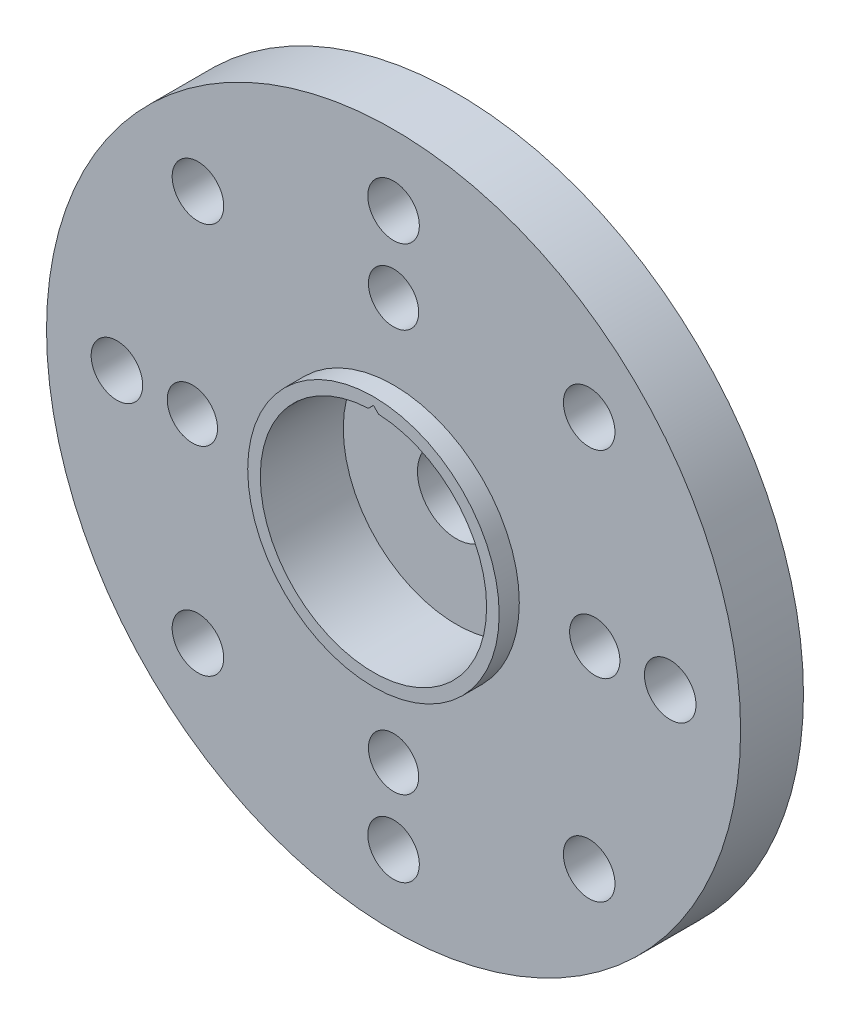
ISO-10303-21;
HEADER;
FILE_DESCRIPTION(('STEP AP214'),'2;1');
FILE_NAME('part.step','',(''),(''),'','','');
FILE_SCHEMA(('AUTOMOTIVE_DESIGN { 1 0 10303 214 1 1 1 1 }'));
ENDSEC;
DATA;
#1=APPLICATION_CONTEXT('core data for automotive mechanical design processes');
#2=APPLICATION_PROTOCOL_DEFINITION('international standard','automotive_design',2000,#1);
#3=PRODUCT_CONTEXT('',#1,'mechanical');
#4=PRODUCT('Part','Part','',(#3));
#5=PRODUCT_RELATED_PRODUCT_CATEGORY('part','',(#4));
#6=PRODUCT_DEFINITION_FORMATION('','',#4);
#7=PRODUCT_DEFINITION_CONTEXT('part definition',#1,'design');
#8=PRODUCT_DEFINITION('design','',#6,#7);
#9=PRODUCT_DEFINITION_SHAPE('','',#8);
#10=(LENGTH_UNIT() NAMED_UNIT(*) SI_UNIT(.MILLI.,.METRE.));
#11=(NAMED_UNIT(*) PLANE_ANGLE_UNIT() SI_UNIT($,.RADIAN.));
#12=(NAMED_UNIT(*) SI_UNIT($,.STERADIAN.) SOLID_ANGLE_UNIT());
#13=UNCERTAINTY_MEASURE_WITH_UNIT(LENGTH_MEASURE(1.E-05),#10,'distance_accuracy_value','');
#14=(GEOMETRIC_REPRESENTATION_CONTEXT(3) GLOBAL_UNCERTAINTY_ASSIGNED_CONTEXT((#13)) GLOBAL_UNIT_ASSIGNED_CONTEXT((#10,
#11,#12)) REPRESENTATION_CONTEXT('',''));
#15=CARTESIAN_POINT('',(0.,0.,0.));
#16=DIRECTION('',(0.,0.,1.));
#17=DIRECTION('',(1.,0.,0.));
#18=AXIS2_PLACEMENT_3D('',#15,#16,#17);
#19=CARTESIAN_POINT('',(34.5935785487,62.9199683378,2.5));
#20=DIRECTION('',(0.,0.,-1.));
#21=DIRECTION('',(-1.,0.,0.));
#22=AXIS2_PLACEMENT_3D('',#19,#20,#21);
#23=CYLINDRICAL_SURFACE('',#22,1.025);
#24=CARTESIAN_POINT('',(34.5935785487,62.9199683378,0.));
#25=DIRECTION('',(0.,0.,1.));
#26=DIRECTION('',(1.,0.,0.));
#27=AXIS2_PLACEMENT_3D('',#24,#25,#26);
#28=CIRCLE('',#27,1.025);
#29=CARTESIAN_POINT('',(35.6185785487,62.9199683378,0.));
#30=VERTEX_POINT('',#29);
#31=EDGE_CURVE('E266',#30,#30,#28,.T.);
#32=ORIENTED_EDGE('',*,*,#31,.F.);
#33=EDGE_LOOP('',(#32));
#34=FACE_BOUND('',#33,.T.);
#35=CARTESIAN_POINT('',(34.5935785487,62.9199683378,2.5));
#36=DIRECTION('',(0.,0.,1.));
#37=DIRECTION('',(1.,0.,0.));
#38=AXIS2_PLACEMENT_3D('',#35,#36,#37);
#39=CIRCLE('',#38,1.025);
#40=CARTESIAN_POINT('',(35.6185785487,62.9199683378,2.5));
#41=VERTEX_POINT('',#40);
#42=EDGE_CURVE('E37',#41,#41,#39,.T.);
#43=ORIENTED_EDGE('',*,*,#42,.T.);
#44=EDGE_LOOP('',(#43));
#45=FACE_BOUND('',#44,.T.);
#46=ADVANCED_FACE('F33',(#34,#45),#23,.F.);
#47=CARTESIAN_POINT('',(26.8154039557,44.1417937448,2.5));
#48=DIRECTION('',(0.,0.,-1.));
#49=DIRECTION('',(-1.,0.,0.));
#50=AXIS2_PLACEMENT_3D('',#47,#48,#49);
#51=CYLINDRICAL_SURFACE('',#50,1.025);
#52=CARTESIAN_POINT('',(26.8154039557,44.1417937448,2.5));
#53=DIRECTION('',(0.,0.,1.));
#54=DIRECTION('',(1.,0.,0.));
#55=AXIS2_PLACEMENT_3D('',#52,#53,#54);
#56=CIRCLE('',#55,1.025);
#57=CARTESIAN_POINT('',(27.8404039557,44.1417937448,2.5));
#58=VERTEX_POINT('',#57);
#59=EDGE_CURVE('E42',#58,#58,#56,.T.);
#60=ORIENTED_EDGE('',*,*,#59,.T.);
#61=EDGE_LOOP('',(#60));
#62=FACE_BOUND('',#61,.T.);
#63=CARTESIAN_POINT('',(26.8154039557,44.1417937448,0.));
#64=DIRECTION('',(0.,0.,1.));
#65=DIRECTION('',(1.,0.,0.));
#66=AXIS2_PLACEMENT_3D('',#63,#64,#65);
#67=CIRCLE('',#66,1.025);
#68=CARTESIAN_POINT('',(27.8404039557,44.1417937448,0.));
#69=VERTEX_POINT('',#68);
#70=EDGE_CURVE('E285',#69,#69,#67,.T.);
#71=ORIENTED_EDGE('',*,*,#70,.F.);
#72=EDGE_LOOP('',(#71));
#73=FACE_BOUND('',#72,.T.);
#74=ADVANCED_FACE('F297',(#62,#73),#51,.F.);
#75=CARTESIAN_POINT('',(26.8154039557,59.6981429309,2.5));
#76=DIRECTION('',(0.,0.,-1.));
#77=DIRECTION('',(-1.,0.,0.));
#78=AXIS2_PLACEMENT_3D('',#75,#76,#77);
#79=CYLINDRICAL_SURFACE('',#78,1.025);
#80=CARTESIAN_POINT('',(26.8154039557,59.6981429309,2.5));
#81=DIRECTION('',(0.,0.,1.));
#82=DIRECTION('',(1.,0.,0.));
#83=AXIS2_PLACEMENT_3D('',#80,#81,#82);
#84=CIRCLE('',#83,1.025);
#85=CARTESIAN_POINT('',(27.8404039557,59.6981429309,2.5));
#86=VERTEX_POINT('',#85);
#87=EDGE_CURVE('E250',#86,#86,#84,.T.);
#88=ORIENTED_EDGE('',*,*,#87,.T.);
#89=EDGE_LOOP('',(#88));
#90=FACE_BOUND('',#89,.T.);
#91=CARTESIAN_POINT('',(26.8154039557,59.6981429309,0.));
#92=DIRECTION('',(0.,0.,1.));
#93=DIRECTION('',(1.,0.,0.));
#94=AXIS2_PLACEMENT_3D('',#91,#92,#93);
#95=CIRCLE('',#94,1.025);
#96=CARTESIAN_POINT('',(27.8404039557,59.6981429309,0.));
#97=VERTEX_POINT('',#96);
#98=EDGE_CURVE('E282',#97,#97,#95,.T.);
#99=ORIENTED_EDGE('',*,*,#98,.F.);
#100=EDGE_LOOP('',(#99));
#101=FACE_BOUND('',#100,.T.);
#102=ADVANCED_FACE('F345',(#90,#101),#79,.F.);
#103=CARTESIAN_POINT('',(23.5935785487,51.9199683378,2.5));
#104=DIRECTION('',(0.,0.,-1.));
#105=DIRECTION('',(-1.,0.,0.));
#106=AXIS2_PLACEMENT_3D('',#103,#104,#105);
#107=CYLINDRICAL_SURFACE('',#106,1.025);
#108=CARTESIAN_POINT('',(23.5935785487,51.9199683378,2.5));
#109=DIRECTION('',(0.,0.,1.));
#110=DIRECTION('',(1.,0.,0.));
#111=AXIS2_PLACEMENT_3D('',#108,#109,#110);
#112=CIRCLE('',#111,1.025);
#113=CARTESIAN_POINT('',(24.6185785487,51.9199683378,2.5));
#114=VERTEX_POINT('',#113);
#115=EDGE_CURVE('E247',#114,#114,#112,.T.);
#116=ORIENTED_EDGE('',*,*,#115,.T.);
#117=EDGE_LOOP('',(#116));
#118=FACE_BOUND('',#117,.T.);
#119=CARTESIAN_POINT('',(23.5935785487,51.9199683378,0.));
#120=DIRECTION('',(0.,0.,1.));
#121=DIRECTION('',(1.,0.,0.));
#122=AXIS2_PLACEMENT_3D('',#119,#120,#121);
#123=CIRCLE('',#122,1.025);
#124=CARTESIAN_POINT('',(24.6185785487,51.9199683378,0.));
#125=VERTEX_POINT('',#124);
#126=EDGE_CURVE('E279',#125,#125,#123,.T.);
#127=ORIENTED_EDGE('',*,*,#126,.F.);
#128=EDGE_LOOP('',(#127));
#129=FACE_BOUND('',#128,.T.);
#130=ADVANCED_FACE('F349',(#118,#129),#107,.F.);
#131=CARTESIAN_POINT('',(26.5935785487,51.9199683378,2.5));
#132=DIRECTION('',(0.,0.,-1.));
#133=DIRECTION('',(-1.,0.,0.));
#134=AXIS2_PLACEMENT_3D('',#131,#132,#133);
#135=CYLINDRICAL_SURFACE('',#134,1.);
#136=CARTESIAN_POINT('',(26.5935785487,51.9199683378,2.5));
#137=DIRECTION('',(0.,0.,1.));
#138=DIRECTION('',(1.,0.,0.));
#139=AXIS2_PLACEMENT_3D('',#136,#137,#138);
#140=CIRCLE('',#139,1.);
#141=CARTESIAN_POINT('',(27.5935785487,51.9199683378,2.5));
#142=VERTEX_POINT('',#141);
#143=EDGE_CURVE('E244',#142,#142,#140,.T.);
#144=ORIENTED_EDGE('',*,*,#143,.T.);
#145=EDGE_LOOP('',(#144));
#146=FACE_BOUND('',#145,.T.);
#147=CARTESIAN_POINT('',(26.5935785487,51.9199683378,0.));
#148=DIRECTION('',(0.,0.,1.));
#149=DIRECTION('',(1.,0.,0.));
#150=AXIS2_PLACEMENT_3D('',#147,#148,#149);
#151=CIRCLE('',#150,1.);
#152=CARTESIAN_POINT('',(27.5935785487,51.9199683378,0.));
#153=VERTEX_POINT('',#152);
#154=EDGE_CURVE('E276',#153,#153,#151,.T.);
#155=ORIENTED_EDGE('',*,*,#154,.F.);
#156=EDGE_LOOP('',(#155));
#157=FACE_BOUND('',#156,.T.);
#158=ADVANCED_FACE('F353',(#146,#157),#135,.F.);
#159=CARTESIAN_POINT('',(34.5935785487,40.9199683378,2.5));
#160=DIRECTION('',(0.,0.,-1.));
#161=DIRECTION('',(-1.,0.,0.));
#162=AXIS2_PLACEMENT_3D('',#159,#160,#161);
#163=CYLINDRICAL_SURFACE('',#162,1.025);
#164=CARTESIAN_POINT('',(34.5935785487,40.9199683378,2.5));
#165=DIRECTION('',(0.,0.,1.));
#166=DIRECTION('',(1.,0.,0.));
#167=AXIS2_PLACEMENT_3D('',#164,#165,#166);
#168=CIRCLE('',#167,1.025);
#169=CARTESIAN_POINT('',(35.6185785487,40.9199683378,2.5));
#170=VERTEX_POINT('',#169);
#171=EDGE_CURVE('E241',#170,#170,#168,.T.);
#172=ORIENTED_EDGE('',*,*,#171,.T.);
#173=EDGE_LOOP('',(#172));
#174=FACE_BOUND('',#173,.T.);
#175=CARTESIAN_POINT('',(34.5935785487,40.9199683378,0.));
#176=DIRECTION('',(0.,0.,1.));
#177=DIRECTION('',(1.,0.,0.));
#178=AXIS2_PLACEMENT_3D('',#175,#176,#177);
#179=CIRCLE('',#178,1.025);
#180=CARTESIAN_POINT('',(35.6185785487,40.9199683378,0.));
#181=VERTEX_POINT('',#180);
#182=EDGE_CURVE('E273',#181,#181,#179,.T.);
#183=ORIENTED_EDGE('',*,*,#182,.F.);
#184=EDGE_LOOP('',(#183));
#185=FACE_BOUND('',#184,.T.);
#186=ADVANCED_FACE('F357',(#174,#185),#163,.F.);
#187=CARTESIAN_POINT('',(42.3717531418,44.1417937448,2.5));
#188=DIRECTION('',(0.,0.,-1.));
#189=DIRECTION('',(-1.,0.,0.));
#190=AXIS2_PLACEMENT_3D('',#187,#188,#189);
#191=CYLINDRICAL_SURFACE('',#190,1.025);
#192=CARTESIAN_POINT('',(42.3717531418,44.1417937448,2.5));
#193=DIRECTION('',(0.,0.,1.));
#194=DIRECTION('',(1.,0.,0.));
#195=AXIS2_PLACEMENT_3D('',#192,#193,#194);
#196=CIRCLE('',#195,1.025);
#197=CARTESIAN_POINT('',(43.3967531418,44.1417937448,2.5));
#198=VERTEX_POINT('',#197);
#199=EDGE_CURVE('E238',#198,#198,#196,.T.);
#200=ORIENTED_EDGE('',*,*,#199,.T.);
#201=EDGE_LOOP('',(#200));
#202=FACE_BOUND('',#201,.T.);
#203=CARTESIAN_POINT('',(42.3717531418,44.1417937448,0.));
#204=DIRECTION('',(0.,0.,1.));
#205=DIRECTION('',(1.,0.,0.));
#206=AXIS2_PLACEMENT_3D('',#203,#204,#205);
#207=CIRCLE('',#206,1.025);
#208=CARTESIAN_POINT('',(43.3967531418,44.1417937448,0.));
#209=VERTEX_POINT('',#208);
#210=EDGE_CURVE('E270',#209,#209,#207,.T.);
#211=ORIENTED_EDGE('',*,*,#210,.F.);
#212=EDGE_LOOP('',(#211));
#213=FACE_BOUND('',#212,.T.);
#214=ADVANCED_FACE('F361',(#202,#213),#191,.F.);
#215=CARTESIAN_POINT('',(34.5935785487,43.9199683378,2.5));
#216=DIRECTION('',(0.,0.,-1.));
#217=DIRECTION('',(-1.,0.,0.));
#218=AXIS2_PLACEMENT_3D('',#215,#216,#217);
#219=CYLINDRICAL_SURFACE('',#218,1.);
#220=CARTESIAN_POINT('',(34.5935785487,43.9199683378,2.5));
#221=DIRECTION('',(0.,0.,1.));
#222=DIRECTION('',(1.,0.,0.));
#223=AXIS2_PLACEMENT_3D('',#220,#221,#222);
#224=CIRCLE('',#223,1.);
#225=CARTESIAN_POINT('',(35.5935785487,43.9199683378,2.5));
#226=VERTEX_POINT('',#225);
#227=EDGE_CURVE('E235',#226,#226,#224,.T.);
#228=ORIENTED_EDGE('',*,*,#227,.T.);
#229=EDGE_LOOP('',(#228));
#230=FACE_BOUND('',#229,.T.);
#231=CARTESIAN_POINT('',(34.5935785487,43.9199683378,0.));
#232=DIRECTION('',(0.,0.,1.));
#233=DIRECTION('',(1.,0.,0.));
#234=AXIS2_PLACEMENT_3D('',#231,#232,#233);
#235=CIRCLE('',#234,1.);
#236=CARTESIAN_POINT('',(35.5935785487,43.9199683378,0.));
#237=VERTEX_POINT('',#236);
#238=EDGE_CURVE('E267',#237,#237,#235,.T.);
#239=ORIENTED_EDGE('',*,*,#238,.F.);
#240=EDGE_LOOP('',(#239));
#241=FACE_BOUND('',#240,.T.);
#242=ADVANCED_FACE('F365',(#230,#241),#219,.F.);
#243=CARTESIAN_POINT('',(34.5935785487,59.9199683378,2.5));
#244=DIRECTION('',(0.,0.,-1.));
#245=DIRECTION('',(-1.,0.,0.));
#246=AXIS2_PLACEMENT_3D('',#243,#244,#245);
#247=CYLINDRICAL_SURFACE('',#246,1.);
#248=CARTESIAN_POINT('',(34.5935785487,59.9199683378,2.5));
#249=DIRECTION('',(0.,0.,1.));
#250=DIRECTION('',(1.,0.,0.));
#251=AXIS2_PLACEMENT_3D('',#248,#249,#250);
#252=CIRCLE('',#251,1.);
#253=CARTESIAN_POINT('',(35.5935785487,59.9199683378,2.5));
#254=VERTEX_POINT('',#253);
#255=EDGE_CURVE('E229',#254,#254,#252,.T.);
#256=ORIENTED_EDGE('',*,*,#255,.T.);
#257=EDGE_LOOP('',(#256));
#258=FACE_BOUND('',#257,.T.);
#259=CARTESIAN_POINT('',(34.5935785487,59.9199683378,0.));
#260=DIRECTION('',(0.,0.,1.));
#261=DIRECTION('',(1.,0.,0.));
#262=AXIS2_PLACEMENT_3D('',#259,#260,#261);
#263=CIRCLE('',#262,1.);
#264=CARTESIAN_POINT('',(35.5935785487,59.9199683378,0.));
#265=VERTEX_POINT('',#264);
#266=EDGE_CURVE('E263',#265,#265,#263,.T.);
#267=ORIENTED_EDGE('',*,*,#266,.F.);
#268=EDGE_LOOP('',(#267));
#269=FACE_BOUND('',#268,.T.);
#270=ADVANCED_FACE('F368',(#258,#269),#247,.F.);
#271=CARTESIAN_POINT('',(45.5935785487,51.9199683378,2.5));
#272=DIRECTION('',(0.,0.,-1.));
#273=DIRECTION('',(-1.,0.,0.));
#274=AXIS2_PLACEMENT_3D('',#271,#272,#273);
#275=CYLINDRICAL_SURFACE('',#274,1.025);
#276=CARTESIAN_POINT('',(45.5935785487,51.9199683378,2.5));
#277=DIRECTION('',(0.,0.,1.));
#278=DIRECTION('',(1.,0.,0.));
#279=AXIS2_PLACEMENT_3D('',#276,#277,#278);
#280=CIRCLE('',#279,1.025);
#281=CARTESIAN_POINT('',(46.6185785487,51.9199683378,2.5));
#282=VERTEX_POINT('',#281);
#283=EDGE_CURVE('E226',#282,#282,#280,.T.);
#284=ORIENTED_EDGE('',*,*,#283,.T.);
#285=EDGE_LOOP('',(#284));
#286=FACE_BOUND('',#285,.T.);
#287=CARTESIAN_POINT('',(45.5935785487,51.9199683378,0.));
#288=DIRECTION('',(0.,0.,1.));
#289=DIRECTION('',(1.,0.,0.));
#290=AXIS2_PLACEMENT_3D('',#287,#288,#289);
#291=CIRCLE('',#290,1.025);
#292=CARTESIAN_POINT('',(46.6185785487,51.9199683378,0.));
#293=VERTEX_POINT('',#292);
#294=EDGE_CURVE('E260',#293,#293,#291,.T.);
#295=ORIENTED_EDGE('',*,*,#294,.F.);
#296=EDGE_LOOP('',(#295));
#297=FACE_BOUND('',#296,.T.);
#298=ADVANCED_FACE('F373',(#286,#297),#275,.F.);
#299=CARTESIAN_POINT('',(42.5935785487,51.9199683378,2.5));
#300=DIRECTION('',(0.,0.,-1.));
#301=DIRECTION('',(-1.,0.,0.));
#302=AXIS2_PLACEMENT_3D('',#299,#300,#301);
#303=CYLINDRICAL_SURFACE('',#302,1.);
#304=CARTESIAN_POINT('',(42.5935785487,51.9199683378,2.5));
#305=DIRECTION('',(0.,0.,1.));
#306=DIRECTION('',(1.,0.,0.));
#307=AXIS2_PLACEMENT_3D('',#304,#305,#306);
#308=CIRCLE('',#307,1.);
#309=CARTESIAN_POINT('',(43.5935785487,51.9199683378,2.5));
#310=VERTEX_POINT('',#309);
#311=EDGE_CURVE('E222',#310,#310,#308,.T.);
#312=ORIENTED_EDGE('',*,*,#311,.T.);
#313=EDGE_LOOP('',(#312));
#314=FACE_BOUND('',#313,.T.);
#315=CARTESIAN_POINT('',(42.5935785487,51.9199683378,0.));
#316=DIRECTION('',(0.,0.,1.));
#317=DIRECTION('',(1.,0.,0.));
#318=AXIS2_PLACEMENT_3D('',#315,#316,#317);
#319=CIRCLE('',#318,1.);
#320=CARTESIAN_POINT('',(43.5935785487,51.9199683378,0.));
#321=VERTEX_POINT('',#320);
#322=EDGE_CURVE('E257',#321,#321,#319,.T.);
#323=ORIENTED_EDGE('',*,*,#322,.F.);
#324=EDGE_LOOP('',(#323));
#325=FACE_BOUND('',#324,.T.);
#326=ADVANCED_FACE('F376',(#314,#325),#303,.F.);
#327=CARTESIAN_POINT('',(42.3717531418,59.6981429309,2.5));
#328=DIRECTION('',(0.,0.,-1.));
#329=DIRECTION('',(-1.,0.,0.));
#330=AXIS2_PLACEMENT_3D('',#327,#328,#329);
#331=CYLINDRICAL_SURFACE('',#330,1.025);
#332=CARTESIAN_POINT('',(42.3717531418,59.6981429309,2.5));
#333=DIRECTION('',(0.,0.,1.));
#334=DIRECTION('',(1.,0.,0.));
#335=AXIS2_PLACEMENT_3D('',#332,#333,#334);
#336=CIRCLE('',#335,1.025);
#337=CARTESIAN_POINT('',(43.3967531418,59.6981429309,2.5));
#338=VERTEX_POINT('',#337);
#339=EDGE_CURVE('E219',#338,#338,#336,.T.);
#340=ORIENTED_EDGE('',*,*,#339,.T.);
#341=EDGE_LOOP('',(#340));
#342=FACE_BOUND('',#341,.T.);
#343=CARTESIAN_POINT('',(42.3717531418,59.6981429309,0.));
#344=DIRECTION('',(0.,0.,1.));
#345=DIRECTION('',(1.,0.,0.));
#346=AXIS2_PLACEMENT_3D('',#343,#344,#345);
#347=CIRCLE('',#346,1.025);
#348=CARTESIAN_POINT('',(43.3967531418,59.6981429309,0.));
#349=VERTEX_POINT('',#348);
#350=EDGE_CURVE('E218',#349,#349,#347,.T.);
#351=ORIENTED_EDGE('',*,*,#350,.F.);
#352=EDGE_LOOP('',(#351));
#353=FACE_BOUND('',#352,.T.);
#354=ADVANCED_FACE('F35',(#342,#353),#331,.F.);
#355=CARTESIAN_POINT('',(34.5935785486984,51.9199683378318,2.5));
#356=DIRECTION('',(0.,0.,-1.));
#357=DIRECTION('',(-1.,0.,0.));
#358=AXIS2_PLACEMENT_3D('',#355,#356,#357);
#359=CYLINDRICAL_SURFACE('',#358,13.8000000000016);
#360=CARTESIAN_POINT('',(34.5935785486984,51.9199683378318,2.5));
#361=DIRECTION('',(0.,0.,1.));
#362=DIRECTION('',(1.,0.,0.));
#363=AXIS2_PLACEMENT_3D('',#360,#361,#362);
#364=CIRCLE('',#363,13.8000000000016);
#365=CARTESIAN_POINT('',(48.3935785487,51.9199683378318,2.5));
#366=VERTEX_POINT('',#365);
#367=EDGE_CURVE('E11',#366,#366,#364,.T.);
#368=ORIENTED_EDGE('',*,*,#367,.F.);
#369=EDGE_LOOP('',(#368));
#370=FACE_BOUND('',#369,.T.);
#371=CARTESIAN_POINT('',(34.5935785486984,51.9199683378318,0.));
#372=DIRECTION('',(0.,0.,1.));
#373=DIRECTION('',(1.,0.,0.));
#374=AXIS2_PLACEMENT_3D('',#371,#372,#373);
#375=CIRCLE('',#374,13.8000000000016);
#376=CARTESIAN_POINT('',(48.3935785487,51.9199683378318,0.));
#377=VERTEX_POINT('',#376);
#378=EDGE_CURVE('E223',#377,#377,#375,.T.);
#379=ORIENTED_EDGE('',*,*,#378,.T.);
#380=EDGE_LOOP('',(#379));
#381=FACE_BOUND('',#380,.T.);
#382=ADVANCED_FACE('F305',(#370,#381),#359,.T.);
#383=CARTESIAN_POINT('',(0.,0.,2.5));
#384=DIRECTION('',(0.,0.,1.));
#385=DIRECTION('',(1.,0.,0.));
#386=AXIS2_PLACEMENT_3D('',#383,#384,#385);
#387=PLANE('',#386);
#388=ORIENTED_EDGE('',*,*,#339,.F.);
#389=EDGE_LOOP('',(#388));
#390=FACE_BOUND('',#389,.T.);
#391=ORIENTED_EDGE('',*,*,#311,.F.);
#392=EDGE_LOOP('',(#391));
#393=FACE_BOUND('',#392,.T.);
#394=ORIENTED_EDGE('',*,*,#283,.F.);
#395=EDGE_LOOP('',(#394));
#396=FACE_BOUND('',#395,.T.);
#397=ORIENTED_EDGE('',*,*,#255,.F.);
#398=EDGE_LOOP('',(#397));
#399=FACE_BOUND('',#398,.T.);
#400=ORIENTED_EDGE('',*,*,#42,.F.);
#401=EDGE_LOOP('',(#400));
#402=FACE_BOUND('',#401,.T.);
#403=CARTESIAN_POINT('',(34.5935785486984,51.9199683378318,2.5));
#404=DIRECTION('',(0.,0.,1.));
#405=DIRECTION('',(1.,0.,0.));
#406=AXIS2_PLACEMENT_3D('',#403,#404,#405);
#407=CIRCLE('',#406,5.00000000000157);
#408=CARTESIAN_POINT('',(39.5935785487,51.9199683378318,2.5));
#409=VERTEX_POINT('',#408);
#410=EDGE_CURVE('E232',#409,#409,#407,.T.);
#411=ORIENTED_EDGE('',*,*,#410,.F.);
#412=EDGE_LOOP('',(#411));
#413=FACE_BOUND('',#412,.T.);
#414=ORIENTED_EDGE('',*,*,#227,.F.);
#415=EDGE_LOOP('',(#414));
#416=FACE_BOUND('',#415,.T.);
#417=ORIENTED_EDGE('',*,*,#199,.F.);
#418=EDGE_LOOP('',(#417));
#419=FACE_BOUND('',#418,.T.);
#420=ORIENTED_EDGE('',*,*,#171,.F.);
#421=EDGE_LOOP('',(#420));
#422=FACE_BOUND('',#421,.T.);
#423=ORIENTED_EDGE('',*,*,#143,.F.);
#424=EDGE_LOOP('',(#423));
#425=FACE_BOUND('',#424,.T.);
#426=ORIENTED_EDGE('',*,*,#115,.F.);
#427=EDGE_LOOP('',(#426));
#428=FACE_BOUND('',#427,.T.);
#429=ORIENTED_EDGE('',*,*,#87,.F.);
#430=EDGE_LOOP('',(#429));
#431=FACE_BOUND('',#430,.T.);
#432=ORIENTED_EDGE('',*,*,#59,.F.);
#433=EDGE_LOOP('',(#432));
#434=FACE_BOUND('',#433,.T.);
#435=ORIENTED_EDGE('',*,*,#367,.T.);
#436=EDGE_LOOP('',(#435));
#437=FACE_BOUND('',#436,.T.);
#438=ADVANCED_FACE('F302',(#390,#393,#396,#399,#402,#413,#416,#419,#422,#425,#428,#431,#434,
#437),#387,.T.);
#439=CARTESIAN_POINT('',(0.,0.,0.));
#440=DIRECTION('',(0.,0.,1.));
#441=DIRECTION('',(1.,0.,0.));
#442=AXIS2_PLACEMENT_3D('',#439,#440,#441);
#443=PLANE('',#442);
#444=CARTESIAN_POINT('',(34.5935785486984,51.9199683378318,0.));
#445=DIRECTION('',(0.,0.,1.));
#446=DIRECTION('',(1.,0.,0.));
#447=AXIS2_PLACEMENT_3D('',#444,#445,#446);
#448=CIRCLE('',#447,5.00000000000157);
#449=CARTESIAN_POINT('',(39.5935785487,51.9199683378318,0.));
#450=VERTEX_POINT('',#449);
#451=EDGE_CURVE('E182',#450,#450,#448,.T.);
#452=ORIENTED_EDGE('',*,*,#451,.T.);
#453=EDGE_LOOP('',(#452));
#454=FACE_BOUND('',#453,.T.);
#455=ORIENTED_EDGE('',*,*,#350,.T.);
#456=EDGE_LOOP('',(#455));
#457=FACE_BOUND('',#456,.T.);
#458=ORIENTED_EDGE('',*,*,#322,.T.);
#459=EDGE_LOOP('',(#458));
#460=FACE_BOUND('',#459,.T.);
#461=ORIENTED_EDGE('',*,*,#294,.T.);
#462=EDGE_LOOP('',(#461));
#463=FACE_BOUND('',#462,.T.);
#464=ORIENTED_EDGE('',*,*,#266,.T.);
#465=EDGE_LOOP('',(#464));
#466=FACE_BOUND('',#465,.T.);
#467=ORIENTED_EDGE('',*,*,#31,.T.);
#468=EDGE_LOOP('',(#467));
#469=FACE_BOUND('',#468,.T.);
#470=ORIENTED_EDGE('',*,*,#238,.T.);
#471=EDGE_LOOP('',(#470));
#472=FACE_BOUND('',#471,.T.);
#473=ORIENTED_EDGE('',*,*,#210,.T.);
#474=EDGE_LOOP('',(#473));
#475=FACE_BOUND('',#474,.T.);
#476=ORIENTED_EDGE('',*,*,#182,.T.);
#477=EDGE_LOOP('',(#476));
#478=FACE_BOUND('',#477,.T.);
#479=ORIENTED_EDGE('',*,*,#154,.T.);
#480=EDGE_LOOP('',(#479));
#481=FACE_BOUND('',#480,.T.);
#482=ORIENTED_EDGE('',*,*,#126,.T.);
#483=EDGE_LOOP('',(#482));
#484=FACE_BOUND('',#483,.T.);
#485=ORIENTED_EDGE('',*,*,#98,.T.);
#486=EDGE_LOOP('',(#485));
#487=FACE_BOUND('',#486,.T.);
#488=ORIENTED_EDGE('',*,*,#70,.T.);
#489=EDGE_LOOP('',(#488));
#490=FACE_BOUND('',#489,.T.);
#491=ORIENTED_EDGE('',*,*,#378,.F.);
#492=EDGE_LOOP('',(#491));
#493=FACE_BOUND('',#492,.T.);
#494=ADVANCED_FACE('F292',(#454,#457,#460,#463,#466,#469,#472,#475,#478,#481,#484,#487,#490,
#493),#443,.F.);
#495=CARTESIAN_POINT('',(34.5935785486984,51.9199683378318,3.3));
#496=DIRECTION('',(0.,0.,-1.));
#497=DIRECTION('',(-1.,0.,0.));
#498=AXIS2_PLACEMENT_3D('',#495,#496,#497);
#499=CYLINDRICAL_SURFACE('',#498,4.49999999997033);
#500=CARTESIAN_POINT('',(34.5935785486984,51.9199683378318,0.));
#501=DIRECTION('',(0.,0.,1.));
#502=DIRECTION('',(1.,0.,0.));
#503=AXIS2_PLACEMENT_3D('',#500,#501,#502);
#504=CIRCLE('',#503,4.49999999997033);
#505=CARTESIAN_POINT('',(34.3935785487,56.4155216964,0.));
#506=VERTEX_POINT('',#505);
#507=CARTESIAN_POINT('',(34.7935785486994,56.4155216963999,0.));
#508=VERTEX_POINT('',#507);
#509=EDGE_CURVE('E164',#506,#508,#504,.T.);
#510=ORIENTED_EDGE('',*,*,#509,.F.);
#511=DIRECTION('',(0.,0.,-1.));
#512=VECTOR('',#511,1.);
#513=CARTESIAN_POINT('',(34.3935785487,56.4155216964,3.3));
#514=LINE('',#513,#512);
#515=CARTESIAN_POINT('',(34.3935785487,56.4155216964,3.3));
#516=VERTEX_POINT('',#515);
#517=EDGE_CURVE('E215',#516,#506,#514,.T.);
#518=ORIENTED_EDGE('',*,*,#517,.F.);
#519=CARTESIAN_POINT('',(34.5935785486984,51.9199683378318,3.3));
#520=DIRECTION('',(0.,0.,1.));
#521=DIRECTION('',(1.,0.,0.));
#522=AXIS2_PLACEMENT_3D('',#519,#520,#521);
#523=CIRCLE('',#522,4.49999999997033);
#524=CARTESIAN_POINT('',(34.7935785486994,56.4155216963999,3.3));
#525=VERTEX_POINT('',#524);
#526=EDGE_CURVE('E202',#516,#525,#523,.T.);
#527=ORIENTED_EDGE('',*,*,#526,.T.);
#528=DIRECTION('',(0.,0.,-1.));
#529=VECTOR('',#528,1.);
#530=CARTESIAN_POINT('',(34.7935785486994,56.4155216963999,3.3));
#531=LINE('',#530,#529);
#532=EDGE_CURVE('E50',#525,#508,#531,.T.);
#533=ORIENTED_EDGE('',*,*,#532,.T.);
#534=EDGE_LOOP('',(#510,#518,#527,#533));
#535=FACE_BOUND('',#534,.T.);
#536=ADVANCED_FACE('F332',(#535),#499,.F.);
#537=CARTESIAN_POINT('',(43.7413118604226,47.4711465973279,3.3));
#538=DIRECTION('',(0.,0.,-1.));
#539=DIRECTION('',(-1.,0.,0.));
#540=AXIS2_PLACEMENT_3D('',#537,#538,#539);
#541=CYLINDRICAL_SURFACE('',#540,12.9376181726);
#542=ORIENTED_EDGE('',*,*,#517,.T.);
#543=DIRECTION('',(0.,0.,1.));
#544=VECTOR('',#543,1.);
#545=CARTESIAN_POINT('',(34.3935785487,56.4155216964,-1.8));
#546=LINE('',#545,#544);
#547=CARTESIAN_POINT('',(34.3935785487,56.4155216964,-1.8));
#548=VERTEX_POINT('',#547);
#549=EDGE_CURVE('E191',#548,#506,#546,.T.);
#550=ORIENTED_EDGE('',*,*,#549,.F.);
#551=CARTESIAN_POINT('',(43.7413118604226,47.4711465973279,-1.8));
#552=DIRECTION('',(0.,0.,1.));
#553=DIRECTION('',(1.,0.,0.));
#554=AXIS2_PLACEMENT_3D('',#551,#552,#553);
#555=CIRCLE('',#554,12.9376181726);
#556=CARTESIAN_POINT('',(34.5935785488016,56.6199683378281,-1.8));
#557=VERTEX_POINT('',#556);
#558=EDGE_CURVE('E194',#557,#548,#555,.T.);
#559=ORIENTED_EDGE('',*,*,#558,.F.);
#560=DIRECTION('',(0.,0.,-1.));
#561=VECTOR('',#560,1.);
#562=CARTESIAN_POINT('',(34.5935785488016,56.6199683378281,3.3));
#563=LINE('',#562,#561);
#564=CARTESIAN_POINT('',(34.5935785488016,56.6199683378281,3.3));
#565=VERTEX_POINT('',#564);
#566=EDGE_CURVE('E58',#565,#557,#563,.T.);
#567=ORIENTED_EDGE('',*,*,#566,.F.);
#568=CARTESIAN_POINT('',(43.7413118604226,47.4711465973279,3.3));
#569=DIRECTION('',(0.,0.,1.));
#570=DIRECTION('',(1.,0.,0.));
#571=AXIS2_PLACEMENT_3D('',#568,#569,#570);
#572=CIRCLE('',#571,12.9376181726);
#573=EDGE_CURVE('E206',#565,#516,#572,.T.);
#574=ORIENTED_EDGE('',*,*,#573,.T.);
#575=EDGE_LOOP('',(#542,#550,#559,#567,#574));
#576=FACE_BOUND('',#575,.T.);
#577=ADVANCED_FACE('F338',(#576),#541,.F.);
#578=CARTESIAN_POINT('',(25.545841437614,47.5689679253883,3.3));
#579=DIRECTION('',(0.,0.,-1.));
#580=DIRECTION('',(-1.,0.,0.));
#581=AXIS2_PLACEMENT_3D('',#578,#579,#580);
#582=CYLINDRICAL_SURFACE('',#581,12.7977402419);
#583=ORIENTED_EDGE('',*,*,#566,.T.);
#584=CARTESIAN_POINT('',(25.545841437614,47.5689679253883,-1.8));
#585=DIRECTION('',(0.,0.,1.));
#586=DIRECTION('',(1.,0.,0.));
#587=AXIS2_PLACEMENT_3D('',#584,#585,#586);
#588=CIRCLE('',#587,12.7977402419);
#589=CARTESIAN_POINT('',(34.7935785486994,56.4155216963999,-1.8));
#590=VERTEX_POINT('',#589);
#591=EDGE_CURVE('E196',#590,#557,#588,.T.);
#592=ORIENTED_EDGE('',*,*,#591,.F.);
#593=DIRECTION('',(0.,0.,1.));
#594=VECTOR('',#593,1.);
#595=CARTESIAN_POINT('',(34.7935785486994,56.4155216963999,-1.8));
#596=LINE('',#595,#594);
#597=EDGE_CURVE('E189',#590,#508,#596,.T.);
#598=ORIENTED_EDGE('',*,*,#597,.T.);
#599=ORIENTED_EDGE('',*,*,#532,.F.);
#600=CARTESIAN_POINT('',(25.545841437614,47.5689679253883,3.3));
#601=DIRECTION('',(0.,0.,1.));
#602=DIRECTION('',(1.,0.,0.));
#603=AXIS2_PLACEMENT_3D('',#600,#601,#602);
#604=CIRCLE('',#603,12.7977402419);
#605=EDGE_CURVE('E208',#525,#565,#604,.T.);
#606=ORIENTED_EDGE('',*,*,#605,.T.);
#607=EDGE_LOOP('',(#583,#592,#598,#599,#606));
#608=FACE_BOUND('',#607,.T.);
#609=ADVANCED_FACE('F428',(#608),#582,.F.);
#610=CARTESIAN_POINT('',(34.5935785486984,51.9199683378318,3.3));
#611=DIRECTION('',(0.,0.,-1.));
#612=DIRECTION('',(-1.,0.,0.));
#613=AXIS2_PLACEMENT_3D('',#610,#611,#612);
#614=CYLINDRICAL_SURFACE('',#613,5.00000000000157);
#615=ORIENTED_EDGE('',*,*,#410,.T.);
#616=EDGE_LOOP('',(#615));
#617=FACE_BOUND('',#616,.T.);
#618=CARTESIAN_POINT('',(34.5935785486984,51.9199683378318,3.3));
#619=DIRECTION('',(0.,0.,1.));
#620=DIRECTION('',(1.,0.,0.));
#621=AXIS2_PLACEMENT_3D('',#618,#619,#620);
#622=CIRCLE('',#621,5.00000000000157);
#623=CARTESIAN_POINT('',(39.5935785487,51.9199683378318,3.3));
#624=VERTEX_POINT('',#623);
#625=EDGE_CURVE('E210',#624,#624,#622,.T.);
#626=ORIENTED_EDGE('',*,*,#625,.F.);
#627=EDGE_LOOP('',(#626));
#628=FACE_BOUND('',#627,.T.);
#629=ADVANCED_FACE('F422',(#617,#628),#614,.T.);
#630=CARTESIAN_POINT('',(0.,0.,3.3));
#631=DIRECTION('',(0.,0.,1.));
#632=DIRECTION('',(1.,0.,0.));
#633=AXIS2_PLACEMENT_3D('',#630,#631,#632);
#634=PLANE('',#633);
#635=ORIENTED_EDGE('',*,*,#526,.F.);
#636=ORIENTED_EDGE('',*,*,#573,.F.);
#637=ORIENTED_EDGE('',*,*,#605,.F.);
#638=EDGE_LOOP('',(#635,#636,#637));
#639=FACE_BOUND('',#638,.T.);
#640=ORIENTED_EDGE('',*,*,#625,.T.);
#641=EDGE_LOOP('',(#640));
#642=FACE_BOUND('',#641,.T.);
#643=ADVANCED_FACE('F427',(#639,#642),#634,.T.);
#644=CARTESIAN_POINT('',(34.5935785486984,51.9199683378318,-1.8));
#645=DIRECTION('',(0.,0.,1.));
#646=DIRECTION('',(1.,0.,0.));
#647=AXIS2_PLACEMENT_3D('',#644,#645,#646);
#648=CYLINDRICAL_SURFACE('',#647,5.00000000000157);
#649=CARTESIAN_POINT('',(34.5935785486984,51.9199683378318,-1.8));
#650=DIRECTION('',(0.,0.,1.));
#651=DIRECTION('',(1.,0.,0.));
#652=AXIS2_PLACEMENT_3D('',#649,#650,#651);
#653=CIRCLE('',#652,5.00000000000157);
#654=CARTESIAN_POINT('',(39.5935785487,51.9199683378318,-1.8));
#655=VERTEX_POINT('',#654);
#656=EDGE_CURVE('E199',#655,#655,#653,.T.);
#657=ORIENTED_EDGE('',*,*,#656,.T.);
#658=EDGE_LOOP('',(#657));
#659=FACE_BOUND('',#658,.T.);
#660=ORIENTED_EDGE('',*,*,#451,.F.);
#661=EDGE_LOOP('',(#660));
#662=FACE_BOUND('',#661,.T.);
#663=ADVANCED_FACE('F439',(#659,#662),#648,.T.);
#664=CARTESIAN_POINT('',(0.,0.,-1.8));
#665=DIRECTION('',(0.,0.,1.));
#666=DIRECTION('',(1.,0.,0.));
#667=AXIS2_PLACEMENT_3D('',#664,#665,#666);
#668=PLANE('',#667);
#669=ORIENTED_EDGE('',*,*,#558,.T.);
#670=DIRECTION('',(0.,-1.,0.));
#671=VECTOR('',#670,1.);
#672=CARTESIAN_POINT('',(34.3935785487,0.,-1.8));
#673=LINE('',#672,#671);
#674=CARTESIAN_POINT('',(34.3935785487,55.9650270519,-1.8));
#675=VERTEX_POINT('',#674);
#676=EDGE_CURVE('E140',#548,#675,#673,.T.);
#677=ORIENTED_EDGE('',*,*,#676,.T.);
#678=CARTESIAN_POINT('',(26.4389367657379,47.6069474158244,-1.8));
#679=DIRECTION('',(0.,0.,1.));
#680=DIRECTION('',(1.,0.,0.));
#681=AXIS2_PLACEMENT_3D('',#678,#679,#680);
#682=CIRCLE('',#681,11.5383630164);
#683=CARTESIAN_POINT('',(34.5092101152421,55.8534320706643,-1.8));
#684=VERTEX_POINT('',#683);
#685=EDGE_CURVE('E119',#684,#675,#682,.T.);
#686=ORIENTED_EDGE('',*,*,#685,.F.);
#687=DIRECTION('',(0.766044443083334,0.642787609729018,0.));
#688=VECTOR('',#687,1.);
#689=CARTESIAN_POINT('',(-13.2440721334162,15.7836705437981,-1.8));
#690=LINE('',#689,#688);
#691=CARTESIAN_POINT('',(34.5292997878,55.8702893075,-1.8));
#692=VERTEX_POINT('',#691);
#693=EDGE_CURVE('E129',#684,#692,#690,.T.);
#694=ORIENTED_EDGE('',*,*,#693,.T.);
#695=CARTESIAN_POINT('',(34.59357854875,55.7936848631725,-1.8));
#696=DIRECTION('',(0.,0.,1.));
#697=DIRECTION('',(1.,0.,0.));
#698=AXIS2_PLACEMENT_3D('',#695,#696,#697);
#699=CIRCLE('',#698,0.0999999999999994);
#700=CARTESIAN_POINT('',(34.6578573097,55.8702893075,-1.8));
#701=VERTEX_POINT('',#700);
#702=EDGE_CURVE('E154',#701,#692,#699,.T.);
#703=ORIENTED_EDGE('',*,*,#702,.F.);
#704=DIRECTION('',(-0.766044443083334,0.642787609729018,0.));
#705=VECTOR('',#704,1.);
#706=CARTESIAN_POINT('',(41.8305388119762,49.8516949037101,-1.8));
#707=LINE('',#706,#705);
#708=CARTESIAN_POINT('',(34.677946982205,55.8534320707087,-1.8));
#709=VERTEX_POINT('',#708);
#710=EDGE_CURVE('E151',#709,#701,#707,.T.);
#711=ORIENTED_EDGE('',*,*,#710,.F.);
#712=CARTESIAN_POINT('',(42.6904050058084,47.6668540229357,-1.8));
#713=DIRECTION('',(0.,0.,1.));
#714=DIRECTION('',(1.,0.,0.));
#715=AXIS2_PLACEMENT_3D('',#712,#713,#714);
#716=CIRCLE('',#715,11.4551099389);
#717=CARTESIAN_POINT('',(34.7935785487018,55.9650270518997,-1.8));
#718=VERTEX_POINT('',#717);
#719=EDGE_CURVE('E148',#718,#709,#716,.T.);
#720=ORIENTED_EDGE('',*,*,#719,.F.);
#721=DIRECTION('',(5.12914348308168E-12,-1.,0.));
#722=VECTOR('',#721,1.);
#723=CARTESIAN_POINT('',(34.7935785489888,1.78461256667636E-10,-1.8));
#724=LINE('',#723,#722);
#725=EDGE_CURVE('E143',#590,#718,#724,.T.);
#726=ORIENTED_EDGE('',*,*,#725,.F.);
#727=ORIENTED_EDGE('',*,*,#591,.T.);
#728=EDGE_LOOP('',(#669,#677,#686,#694,#703,#711,#720,#726,#727));
#729=FACE_BOUND('',#728,.T.);
#730=ORIENTED_EDGE('',*,*,#656,.F.);
#731=EDGE_LOOP('',(#730));
#732=FACE_BOUND('',#731,.T.);
#733=CARTESIAN_POINT('',(34.5935785486984,51.9199683378318,-1.8));
#734=DIRECTION('',(0.,0.,1.));
#735=DIRECTION('',(1.,0.,0.));
#736=AXIS2_PLACEMENT_3D('',#733,#734,#735);
#737=CIRCLE('',#736,1.55000000000158);
#738=CARTESIAN_POINT('',(36.1435785487,51.9199683378318,-1.8));
#739=VERTEX_POINT('',#738);
#740=EDGE_CURVE('E126',#739,#739,#737,.T.);
#741=ORIENTED_EDGE('',*,*,#740,.T.);
#742=EDGE_LOOP('',(#741));
#743=FACE_BOUND('',#742,.T.);
#744=ADVANCED_FACE('F138',(#729,#732,#743),#668,.F.);
#745=CARTESIAN_POINT('',(-13.2440721334162,15.7836705437981,-1.8));
#746=DIRECTION('',(0.642787609729018,-0.766044443083334,0.));
#747=DIRECTION('',(0.766044443083334,0.642787609729018,0.));
#748=AXIS2_PLACEMENT_3D('',#745,#746,#747);
#749=PLANE('',#748);
#750=DIRECTION('',(0.766044443083334,0.642787609729018,0.));
#751=VECTOR('',#750,1.);
#752=CARTESIAN_POINT('',(-13.2440721334162,15.7836705437981,0.));
#753=LINE('',#752,#751);
#754=CARTESIAN_POINT('',(34.5092101152421,55.8534320706643,0.));
#755=VERTEX_POINT('',#754);
#756=CARTESIAN_POINT('',(34.5292997878,55.8702893075,0.));
#757=VERTEX_POINT('',#756);
#758=EDGE_CURVE('E158',#755,#757,#753,.T.);
#759=ORIENTED_EDGE('',*,*,#758,.T.);
#760=DIRECTION('',(0.,0.,1.));
#761=VECTOR('',#760,1.);
#762=CARTESIAN_POINT('',(34.5292997878,55.8702893075,-1.8));
#763=LINE('',#762,#761);
#764=EDGE_CURVE('E131',#692,#757,#763,.T.);
#765=ORIENTED_EDGE('',*,*,#764,.F.);
#766=ORIENTED_EDGE('',*,*,#693,.F.);
#767=DIRECTION('',(0.,0.,1.));
#768=VECTOR('',#767,1.);
#769=CARTESIAN_POINT('',(34.5092101152421,55.8534320706643,-1.8));
#770=LINE('',#769,#768);
#771=EDGE_CURVE('E115',#684,#755,#770,.T.);
#772=ORIENTED_EDGE('',*,*,#771,.T.);
#773=EDGE_LOOP('',(#759,#765,#766,#772));
#774=FACE_BOUND('',#773,.T.);
#775=ADVANCED_FACE('F130',(#774),#749,.F.);
#776=CARTESIAN_POINT('',(34.59357854875,55.7936848631725,-1.8));
#777=DIRECTION('',(0.,0.,1.));
#778=DIRECTION('',(1.,0.,0.));
#779=AXIS2_PLACEMENT_3D('',#776,#777,#778);
#780=CYLINDRICAL_SURFACE('',#779,0.0999999999999994);
#781=CARTESIAN_POINT('',(34.59357854875,55.7936848631725,0.));
#782=DIRECTION('',(0.,0.,1.));
#783=DIRECTION('',(1.,0.,0.));
#784=AXIS2_PLACEMENT_3D('',#781,#782,#783);
#785=CIRCLE('',#784,0.0999999999999994);
#786=CARTESIAN_POINT('',(34.6578573097,55.8702893075,0.));
#787=VERTEX_POINT('',#786);
#788=EDGE_CURVE('E176',#787,#757,#785,.T.);
#789=ORIENTED_EDGE('',*,*,#788,.F.);
#790=DIRECTION('',(0.,0.,1.));
#791=VECTOR('',#790,1.);
#792=CARTESIAN_POINT('',(34.6578573097,55.8702893075,-1.8));
#793=LINE('',#792,#791);
#794=EDGE_CURVE('E183',#701,#787,#793,.T.);
#795=ORIENTED_EDGE('',*,*,#794,.F.);
#796=ORIENTED_EDGE('',*,*,#702,.T.);
#797=ORIENTED_EDGE('',*,*,#764,.T.);
#798=EDGE_LOOP('',(#789,#795,#796,#797));
#799=FACE_BOUND('',#798,.T.);
#800=ADVANCED_FACE('F496',(#799),#780,.T.);
#801=CARTESIAN_POINT('',(41.8305388119762,49.8516949037101,-1.8));
#802=DIRECTION('',(0.642787609729018,0.766044443083334,0.));
#803=DIRECTION('',(-0.766044443083334,0.642787609729018,0.));
#804=AXIS2_PLACEMENT_3D('',#801,#802,#803);
#805=PLANE('',#804);
#806=DIRECTION('',(-0.766044443083334,0.642787609729018,0.));
#807=VECTOR('',#806,1.);
#808=CARTESIAN_POINT('',(41.8305388119762,49.8516949037101,0.));
#809=LINE('',#808,#807);
#810=CARTESIAN_POINT('',(34.677946982205,55.8534320707087,0.));
#811=VERTEX_POINT('',#810);
#812=EDGE_CURVE('E173',#811,#787,#809,.T.);
#813=ORIENTED_EDGE('',*,*,#812,.F.);
#814=DIRECTION('',(0.,0.,1.));
#815=VECTOR('',#814,1.);
#816=CARTESIAN_POINT('',(34.677946982205,55.8534320707087,-1.8));
#817=LINE('',#816,#815);
#818=EDGE_CURVE('E185',#709,#811,#817,.T.);
#819=ORIENTED_EDGE('',*,*,#818,.F.);
#820=ORIENTED_EDGE('',*,*,#710,.T.);
#821=ORIENTED_EDGE('',*,*,#794,.T.);
#822=EDGE_LOOP('',(#813,#819,#820,#821));
#823=FACE_BOUND('',#822,.T.);
#824=ADVANCED_FACE('F505',(#823),#805,.T.);
#825=CARTESIAN_POINT('',(42.6904050058084,47.6668540229357,-1.8));
#826=DIRECTION('',(0.,0.,1.));
#827=DIRECTION('',(1.,0.,0.));
#828=AXIS2_PLACEMENT_3D('',#825,#826,#827);
#829=CYLINDRICAL_SURFACE('',#828,11.4551099389);
#830=CARTESIAN_POINT('',(42.6904050058084,47.6668540229357,0.));
#831=DIRECTION('',(0.,0.,1.));
#832=DIRECTION('',(1.,0.,0.));
#833=AXIS2_PLACEMENT_3D('',#830,#831,#832);
#834=CIRCLE('',#833,11.4551099389);
#835=CARTESIAN_POINT('',(34.7935785487018,55.9650270518997,0.));
#836=VERTEX_POINT('',#835);
#837=EDGE_CURVE('E170',#836,#811,#834,.T.);
#838=ORIENTED_EDGE('',*,*,#837,.F.);
#839=DIRECTION('',(0.,0.,1.));
#840=VECTOR('',#839,1.);
#841=CARTESIAN_POINT('',(34.7935785487018,55.9650270518997,-1.8));
#842=LINE('',#841,#840);
#843=EDGE_CURVE('E187',#718,#836,#842,.T.);
#844=ORIENTED_EDGE('',*,*,#843,.F.);
#845=ORIENTED_EDGE('',*,*,#719,.T.);
#846=ORIENTED_EDGE('',*,*,#818,.T.);
#847=EDGE_LOOP('',(#838,#844,#845,#846));
#848=FACE_BOUND('',#847,.T.);
#849=ADVANCED_FACE('F515',(#848),#829,.T.);
#850=CARTESIAN_POINT('',(34.7935785489888,1.78461256667636E-10,-1.8));
#851=DIRECTION('',(-1.,-5.12914348308168E-12,0.));
#852=DIRECTION('',(5.12914348308168E-12,-1.,0.));
#853=AXIS2_PLACEMENT_3D('',#850,#851,#852);
#854=PLANE('',#853);
#855=DIRECTION('',(5.12914348308168E-12,-1.,0.));
#856=VECTOR('',#855,1.);
#857=CARTESIAN_POINT('',(34.7935785489888,1.78461256667636E-10,0.));
#858=LINE('',#857,#856);
#859=EDGE_CURVE('E167',#508,#836,#858,.T.);
#860=ORIENTED_EDGE('',*,*,#859,.F.);
#861=ORIENTED_EDGE('',*,*,#597,.F.);
#862=ORIENTED_EDGE('',*,*,#725,.T.);
#863=ORIENTED_EDGE('',*,*,#843,.T.);
#864=EDGE_LOOP('',(#860,#861,#862,#863));
#865=FACE_BOUND('',#864,.T.);
#866=ADVANCED_FACE('F525',(#865),#854,.T.);
#867=CARTESIAN_POINT('',(34.3935785487,0.,-1.8));
#868=DIRECTION('',(-1.,0.,0.));
#869=DIRECTION('',(0.,0.,1.));
#870=AXIS2_PLACEMENT_3D('',#867,#868,#869);
#871=PLANE('',#870);
#872=DIRECTION('',(0.,-1.,0.));
#873=VECTOR('',#872,1.);
#874=CARTESIAN_POINT('',(34.3935785487,0.,0.));
#875=LINE('',#874,#873);
#876=CARTESIAN_POINT('',(34.3935785487,55.9650270519,0.));
#877=VERTEX_POINT('',#876);
#878=EDGE_CURVE('E161',#506,#877,#875,.T.);
#879=ORIENTED_EDGE('',*,*,#878,.T.);
#880=DIRECTION('',(0.,0.,1.));
#881=VECTOR('',#880,1.);
#882=CARTESIAN_POINT('',(34.3935785487,55.9650270519,-1.8));
#883=LINE('',#882,#881);
#884=EDGE_CURVE('E125',#675,#877,#883,.T.);
#885=ORIENTED_EDGE('',*,*,#884,.F.);
#886=ORIENTED_EDGE('',*,*,#676,.F.);
#887=ORIENTED_EDGE('',*,*,#549,.T.);
#888=EDGE_LOOP('',(#879,#885,#886,#887));
#889=FACE_BOUND('',#888,.T.);
#890=ADVANCED_FACE('F535',(#889),#871,.F.);
#891=CARTESIAN_POINT('',(26.4389367657379,47.6069474158244,-1.8));
#892=DIRECTION('',(0.,0.,1.));
#893=DIRECTION('',(1.,0.,0.));
#894=AXIS2_PLACEMENT_3D('',#891,#892,#893);
#895=CYLINDRICAL_SURFACE('',#894,11.5383630164);
#896=CARTESIAN_POINT('',(26.4389367657379,47.6069474158244,0.));
#897=DIRECTION('',(0.,0.,1.));
#898=DIRECTION('',(1.,0.,0.));
#899=AXIS2_PLACEMENT_3D('',#896,#897,#898);
#900=CIRCLE('',#899,11.5383630164);
#901=EDGE_CURVE('E121',#755,#877,#900,.T.);
#902=ORIENTED_EDGE('',*,*,#901,.F.);
#903=ORIENTED_EDGE('',*,*,#771,.F.);
#904=ORIENTED_EDGE('',*,*,#685,.T.);
#905=ORIENTED_EDGE('',*,*,#884,.T.);
#906=EDGE_LOOP('',(#902,#903,#904,#905));
#907=FACE_BOUND('',#906,.T.);
#908=ADVANCED_FACE('F117',(#907),#895,.T.);
#909=CARTESIAN_POINT('',(34.5935785486984,51.9199683378318,-1.8));
#910=DIRECTION('',(0.,0.,1.));
#911=DIRECTION('',(1.,0.,0.));
#912=AXIS2_PLACEMENT_3D('',#909,#910,#911);
#913=CYLINDRICAL_SURFACE('',#912,1.55000000000158);
#914=ORIENTED_EDGE('',*,*,#740,.F.);
#915=EDGE_LOOP('',(#914));
#916=FACE_BOUND('',#915,.T.);
#917=CARTESIAN_POINT('',(34.5935785486984,51.9199683378318,0.));
#918=DIRECTION('',(0.,0.,1.));
#919=DIRECTION('',(1.,0.,0.));
#920=AXIS2_PLACEMENT_3D('',#917,#918,#919);
#921=CIRCLE('',#920,1.55000000000158);
#922=CARTESIAN_POINT('',(36.1435785487,51.9199683378318,0.));
#923=VERTEX_POINT('',#922);
#924=EDGE_CURVE('E135',#923,#923,#921,.T.);
#925=ORIENTED_EDGE('',*,*,#924,.T.);
#926=EDGE_LOOP('',(#925));
#927=FACE_BOUND('',#926,.T.);
#928=ADVANCED_FACE('F554',(#916,#927),#913,.F.);
#929=CARTESIAN_POINT('',(0.,0.,0.));
#930=DIRECTION('',(0.,0.,1.));
#931=DIRECTION('',(1.,0.,0.));
#932=AXIS2_PLACEMENT_3D('',#929,#930,#931);
#933=PLANE('',#932);
#934=ORIENTED_EDGE('',*,*,#758,.F.);
#935=ORIENTED_EDGE('',*,*,#901,.T.);
#936=ORIENTED_EDGE('',*,*,#878,.F.);
#937=ORIENTED_EDGE('',*,*,#509,.T.);
#938=ORIENTED_EDGE('',*,*,#859,.T.);
#939=ORIENTED_EDGE('',*,*,#837,.T.);
#940=ORIENTED_EDGE('',*,*,#812,.T.);
#941=ORIENTED_EDGE('',*,*,#788,.T.);
#942=EDGE_LOOP('',(#934,#935,#936,#937,#938,#939,#940,#941));
#943=FACE_BOUND('',#942,.T.);
#944=ORIENTED_EDGE('',*,*,#924,.F.);
#945=EDGE_LOOP('',(#944));
#946=FACE_BOUND('',#945,.T.);
#947=ADVANCED_FACE('F563',(#943,#946),#933,.T.);
#948=CLOSED_SHELL('',(#46,#74,#102,#130,#158,#186,#214,#242,#270,#298,#326,#354,#382,#438,#494,
#536,#577,#609,#629,#643,#663,#744,#775,#800,#824,#849,#866,#890,#908,#928,#947));
#949=MANIFOLD_SOLID_BREP('B2',#948);
#950=ADVANCED_BREP_SHAPE_REPRESENTATION('',(#18,#949),#14);
#951=SHAPE_DEFINITION_REPRESENTATION(#9,#950);
ENDSEC;
END-ISO-10303-21;
